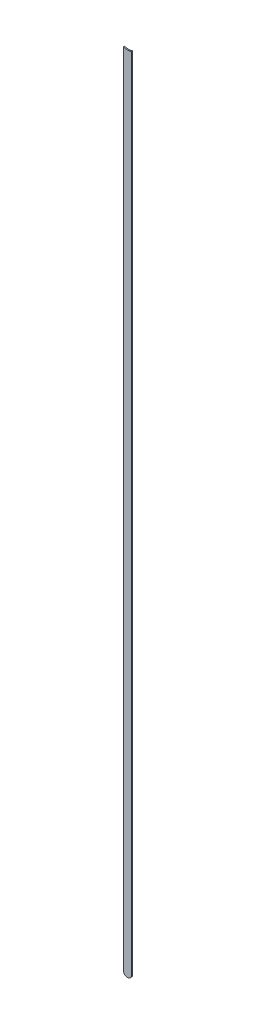
ISO-10303-21;
HEADER;
FILE_DESCRIPTION(('STEP AP214'),'2;1');
FILE_NAME('part.step','',(''),(''),'','','');
FILE_SCHEMA(('AUTOMOTIVE_DESIGN { 1 0 10303 214 1 1 1 1 }'));
ENDSEC;
DATA;
#1=APPLICATION_CONTEXT('core data for automotive mechanical design processes');
#2=APPLICATION_PROTOCOL_DEFINITION('international standard','automotive_design',2000,#1);
#3=PRODUCT_CONTEXT('',#1,'mechanical');
#4=PRODUCT('Part','Part','',(#3));
#5=PRODUCT_RELATED_PRODUCT_CATEGORY('part','',(#4));
#6=PRODUCT_DEFINITION_FORMATION('','',#4);
#7=PRODUCT_DEFINITION_CONTEXT('part definition',#1,'design');
#8=PRODUCT_DEFINITION('design','',#6,#7);
#9=PRODUCT_DEFINITION_SHAPE('','',#8);
#10=(LENGTH_UNIT() NAMED_UNIT(*) SI_UNIT(.MILLI.,.METRE.));
#11=(NAMED_UNIT(*) PLANE_ANGLE_UNIT() SI_UNIT($,.RADIAN.));
#12=(NAMED_UNIT(*) SI_UNIT($,.STERADIAN.) SOLID_ANGLE_UNIT());
#13=UNCERTAINTY_MEASURE_WITH_UNIT(LENGTH_MEASURE(1.E-05),#10,'distance_accuracy_value','');
#14=(GEOMETRIC_REPRESENTATION_CONTEXT(3) GLOBAL_UNCERTAINTY_ASSIGNED_CONTEXT((#13)) GLOBAL_UNIT_ASSIGNED_CONTEXT((#10,
#11,#12)) REPRESENTATION_CONTEXT('',''));
#15=CARTESIAN_POINT('',(0.,0.,0.));
#16=DIRECTION('',(0.,0.,1.));
#17=DIRECTION('',(1.,0.,0.));
#18=AXIS2_PLACEMENT_3D('',#15,#16,#17);
#19=CARTESIAN_POINT('',(77.94397162,54.7869745,0.));
#20=DIRECTION('',(-1.,0.,0.));
#21=DIRECTION('',(0.,1.,0.));
#22=AXIS2_PLACEMENT_3D('',#19,#20,#21);
#23=PLANE('',#22);
#24=DIRECTION('',(0.,1.,0.));
#25=VECTOR('',#24,1.);
#26=CARTESIAN_POINT('',(77.94397162,54.7869745,0.03556));
#27=LINE('',#26,#25);
#28=CARTESIAN_POINT('',(77.94397162,54.7869745,0.03556));
#29=VERTEX_POINT('',#28);
#30=CARTESIAN_POINT('',(77.94397162,79.3548248605022,0.03556));
#31=VERTEX_POINT('',#30);
#32=EDGE_CURVE('E11',#29,#31,#27,.T.);
#33=ORIENTED_EDGE('',*,*,#32,.F.);
#34=DIRECTION('',(0.,0.,1.));
#35=VECTOR('',#34,1.);
#36=CARTESIAN_POINT('',(77.94397162,54.7869745,0.));
#37=LINE('',#36,#35);
#38=CARTESIAN_POINT('',(77.94397162,54.7869745,0.));
#39=VERTEX_POINT('',#38);
#40=EDGE_CURVE('E24',#39,#29,#37,.T.);
#41=ORIENTED_EDGE('',*,*,#40,.F.);
#42=DIRECTION('',(0.,1.,0.));
#43=VECTOR('',#42,1.);
#44=CARTESIAN_POINT('',(77.94397162,54.7869745,0.));
#45=LINE('',#44,#43);
#46=CARTESIAN_POINT('',(77.94397162,79.3548248605022,0.));
#47=VERTEX_POINT('',#46);
#48=EDGE_CURVE('E75',#39,#47,#45,.T.);
#49=ORIENTED_EDGE('',*,*,#48,.T.);
#50=DIRECTION('',(0.,0.,1.));
#51=VECTOR('',#50,1.);
#52=CARTESIAN_POINT('',(77.94397162,79.3548248605022,0.));
#53=LINE('',#52,#51);
#54=EDGE_CURVE('E37',#47,#31,#53,.T.);
#55=ORIENTED_EDGE('',*,*,#54,.T.);
#56=EDGE_LOOP('',(#33,#41,#49,#55));
#57=FACE_BOUND('',#56,.T.);
#58=ADVANCED_FACE('F17',(#57),#23,.F.);
#59=CARTESIAN_POINT('',(77.81697162,79.68697296,0.));
#60=DIRECTION('',(0.,0.,-1.));
#61=DIRECTION('',(1.,0.,0.));
#62=AXIS2_PLACEMENT_3D('',#59,#60,#61);
#63=CYLINDRICAL_SURFACE('',#62,0.3556);
#64=DIRECTION('',(0.,0.,1.));
#65=VECTOR('',#64,1.);
#66=CARTESIAN_POINT('',(77.68997162,79.3548248605022,0.));
#67=LINE('',#66,#65);
#68=CARTESIAN_POINT('',(77.68997162,79.3548248605022,0.));
#69=VERTEX_POINT('',#68);
#70=CARTESIAN_POINT('',(77.68997162,79.3548248605022,0.03556));
#71=VERTEX_POINT('',#70);
#72=EDGE_CURVE('E67',#69,#71,#67,.T.);
#73=ORIENTED_EDGE('',*,*,#72,.T.);
#74=CARTESIAN_POINT('',(77.81697162,79.68697296,0.03556));
#75=DIRECTION('',(0.,0.,1.));
#76=DIRECTION('',(1.,0.,0.));
#77=AXIS2_PLACEMENT_3D('',#74,#75,#76);
#78=CIRCLE('',#77,0.3556);
#79=EDGE_CURVE('E82',#71,#31,#78,.T.);
#80=ORIENTED_EDGE('',*,*,#79,.T.);
#81=ORIENTED_EDGE('',*,*,#54,.F.);
#82=CARTESIAN_POINT('',(77.81697162,79.68697296,0.));
#83=DIRECTION('',(0.,0.,1.));
#84=DIRECTION('',(1.,0.,0.));
#85=AXIS2_PLACEMENT_3D('',#82,#83,#84);
#86=CIRCLE('',#85,0.3556);
#87=EDGE_CURVE('E80',#69,#47,#86,.T.);
#88=ORIENTED_EDGE('',*,*,#87,.F.);
#89=EDGE_LOOP('',(#73,#80,#81,#88));
#90=FACE_BOUND('',#89,.T.);
#91=ADVANCED_FACE('F88',(#90),#63,.F.);
#92=CARTESIAN_POINT('',(77.68997162,79.3548248605022,0.));
#93=DIRECTION('',(1.,0.,0.));
#94=DIRECTION('',(0.,-1.,0.));
#95=AXIS2_PLACEMENT_3D('',#92,#93,#94);
#96=PLANE('',#95);
#97=DIRECTION('',(0.,-1.,0.));
#98=VECTOR('',#97,1.);
#99=CARTESIAN_POINT('',(77.68997162,79.68697296,0.03556));
#100=LINE('',#99,#98);
#101=CARTESIAN_POINT('',(77.68997162,54.7869745,0.03556));
#102=VERTEX_POINT('',#101);
#103=EDGE_CURVE('E71',#71,#102,#100,.T.);
#104=ORIENTED_EDGE('',*,*,#103,.F.);
#105=ORIENTED_EDGE('',*,*,#72,.F.);
#106=DIRECTION('',(0.,-1.,0.));
#107=VECTOR('',#106,1.);
#108=CARTESIAN_POINT('',(77.68997162,79.68697296,0.));
#109=LINE('',#108,#107);
#110=CARTESIAN_POINT('',(77.68997162,54.7869745,0.));
#111=VERTEX_POINT('',#110);
#112=EDGE_CURVE('E63',#69,#111,#109,.T.);
#113=ORIENTED_EDGE('',*,*,#112,.T.);
#114=DIRECTION('',(0.,0.,1.));
#115=VECTOR('',#114,1.);
#116=CARTESIAN_POINT('',(77.68997162,54.7869745,0.));
#117=LINE('',#116,#115);
#118=EDGE_CURVE('E53',#111,#102,#117,.T.);
#119=ORIENTED_EDGE('',*,*,#118,.T.);
#120=EDGE_LOOP('',(#104,#105,#113,#119));
#121=FACE_BOUND('',#120,.T.);
#122=ADVANCED_FACE('F66',(#121),#96,.F.);
#123=CARTESIAN_POINT('',(77.81697162,54.7869745,0.));
#124=DIRECTION('',(0.,0.,-1.));
#125=DIRECTION('',(-1.,0.,0.));
#126=AXIS2_PLACEMENT_3D('',#123,#124,#125);
#127=CYLINDRICAL_SURFACE('',#126,0.126999999999998);
#128=CARTESIAN_POINT('',(77.81697162,54.7869745,0.03556));
#129=DIRECTION('',(0.,0.,1.));
#130=DIRECTION('',(-1.,0.,0.));
#131=AXIS2_PLACEMENT_3D('',#128,#129,#130);
#132=CIRCLE('',#131,0.126999999999998);
#133=EDGE_CURVE('E59',#102,#29,#132,.T.);
#134=ORIENTED_EDGE('',*,*,#133,.F.);
#135=ORIENTED_EDGE('',*,*,#118,.F.);
#136=CARTESIAN_POINT('',(77.81697162,54.7869745,0.));
#137=DIRECTION('',(0.,0.,1.));
#138=DIRECTION('',(-1.,0.,0.));
#139=AXIS2_PLACEMENT_3D('',#136,#137,#138);
#140=CIRCLE('',#139,0.126999999999998);
#141=EDGE_CURVE('E57',#111,#39,#140,.T.);
#142=ORIENTED_EDGE('',*,*,#141,.T.);
#143=ORIENTED_EDGE('',*,*,#40,.T.);
#144=EDGE_LOOP('',(#134,#135,#142,#143));
#145=FACE_BOUND('',#144,.T.);
#146=ADVANCED_FACE('F55',(#145),#127,.T.);
#147=CARTESIAN_POINT('',(77.94397162,54.7869745,0.));
#148=DIRECTION('',(0.,0.,-1.));
#149=DIRECTION('',(-1.,0.,0.));
#150=AXIS2_PLACEMENT_3D('',#147,#148,#149);
#151=PLANE('',#150);
#152=ORIENTED_EDGE('',*,*,#48,.F.);
#153=ORIENTED_EDGE('',*,*,#141,.F.);
#154=ORIENTED_EDGE('',*,*,#112,.F.);
#155=ORIENTED_EDGE('',*,*,#87,.T.);
#156=EDGE_LOOP('',(#152,#153,#154,#155));
#157=FACE_BOUND('',#156,.T.);
#158=ADVANCED_FACE('F74',(#157),#151,.T.);
#159=CARTESIAN_POINT('',(77.94397162,54.7869745,0.03556));
#160=DIRECTION('',(0.,0.,-1.));
#161=DIRECTION('',(-1.,0.,0.));
#162=AXIS2_PLACEMENT_3D('',#159,#160,#161);
#163=PLANE('',#162);
#164=ORIENTED_EDGE('',*,*,#133,.T.);
#165=ORIENTED_EDGE('',*,*,#32,.T.);
#166=ORIENTED_EDGE('',*,*,#79,.F.);
#167=ORIENTED_EDGE('',*,*,#103,.T.);
#168=EDGE_LOOP('',(#164,#165,#166,#167));
#169=FACE_BOUND('',#168,.T.);
#170=ADVANCED_FACE('F91',(#169),#163,.F.);
#171=CLOSED_SHELL('',(#58,#91,#122,#146,#158,#170));
#172=MANIFOLD_SOLID_BREP('B1',#171);
#173=ADVANCED_BREP_SHAPE_REPRESENTATION('',(#18,#172),#14);
#174=SHAPE_DEFINITION_REPRESENTATION(#9,#173);
ENDSEC;
END-ISO-10303-21;
